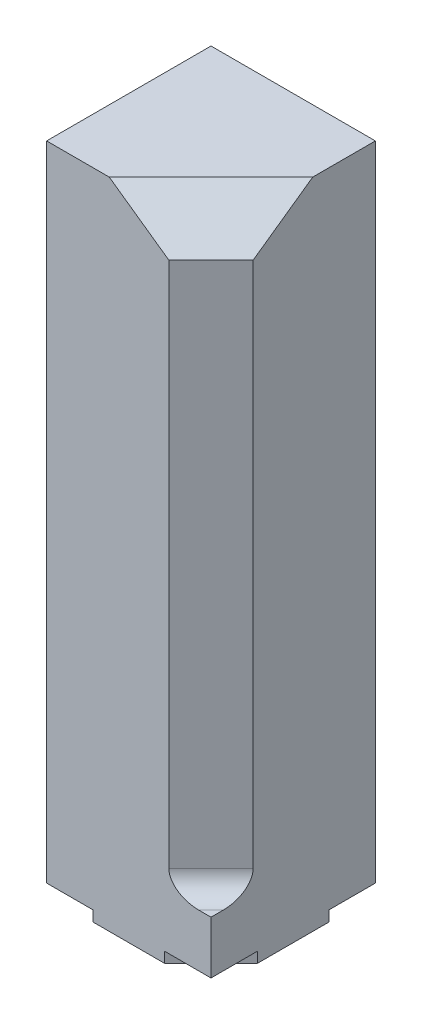
ISO-10303-21;
HEADER;
FILE_DESCRIPTION(('STEP AP214'),'2;1');
FILE_NAME('part.step','',(''),(''),'','','');
FILE_SCHEMA(('AUTOMOTIVE_DESIGN { 1 0 10303 214 1 1 1 1 }'));
ENDSEC;
DATA;
#1=APPLICATION_CONTEXT('core data for automotive mechanical design processes');
#2=APPLICATION_PROTOCOL_DEFINITION('international standard','automotive_design',2000,#1);
#3=PRODUCT_CONTEXT('',#1,'mechanical');
#4=PRODUCT('Part','Part','',(#3));
#5=PRODUCT_RELATED_PRODUCT_CATEGORY('part','',(#4));
#6=PRODUCT_DEFINITION_FORMATION('','',#4);
#7=PRODUCT_DEFINITION_CONTEXT('part definition',#1,'design');
#8=PRODUCT_DEFINITION('design','',#6,#7);
#9=PRODUCT_DEFINITION_SHAPE('','',#8);
#10=(LENGTH_UNIT() NAMED_UNIT(*) SI_UNIT(.MILLI.,.METRE.));
#11=(NAMED_UNIT(*) PLANE_ANGLE_UNIT() SI_UNIT($,.RADIAN.));
#12=(NAMED_UNIT(*) SI_UNIT($,.STERADIAN.) SOLID_ANGLE_UNIT());
#13=UNCERTAINTY_MEASURE_WITH_UNIT(LENGTH_MEASURE(1.E-05),#10,'distance_accuracy_value','');
#14=(GEOMETRIC_REPRESENTATION_CONTEXT(3) GLOBAL_UNCERTAINTY_ASSIGNED_CONTEXT((#13)) GLOBAL_UNIT_ASSIGNED_CONTEXT((#10,
#11,#12)) REPRESENTATION_CONTEXT('',''));
#15=CARTESIAN_POINT('',(0.,0.,0.));
#16=DIRECTION('',(0.,0.,1.));
#17=DIRECTION('',(1.,0.,0.));
#18=AXIS2_PLACEMENT_3D('',#15,#16,#17);
#19=CARTESIAN_POINT('',(0.,0.,0.));
#20=DIRECTION('',(0.,1.,0.));
#21=DIRECTION('',(0.,0.,1.));
#22=AXIS2_PLACEMENT_3D('',#19,#20,#21);
#23=PLANE('',#22);
#24=DIRECTION('',(-1.,0.,0.));
#25=VECTOR('',#24,1.);
#26=CARTESIAN_POINT('',(-1.95,0.,-1.95));
#27=LINE('',#26,#25);
#28=CARTESIAN_POINT('',(0.85,0.,-1.95));
#29=VERTEX_POINT('',#28);
#30=CARTESIAN_POINT('',(-0.85,0.,-1.95));
#31=VERTEX_POINT('',#30);
#32=EDGE_CURVE('E277',#29,#31,#27,.T.);
#33=ORIENTED_EDGE('',*,*,#32,.F.);
#34=DIRECTION('',(-0.707106781186548,0.,-0.707106781186548));
#35=VECTOR('',#34,1.);
#36=CARTESIAN_POINT('',(1.95,0.,-0.85));
#37=LINE('',#36,#35);
#38=CARTESIAN_POINT('',(1.1,0.,-1.7));
#39=VERTEX_POINT('',#38);
#40=EDGE_CURVE('E375',#39,#29,#37,.T.);
#41=ORIENTED_EDGE('',*,*,#40,.F.);
#42=DIRECTION('',(1.,0.,0.));
#43=VECTOR('',#42,1.);
#44=CARTESIAN_POINT('',(1.7,0.,-1.7));
#45=LINE('',#44,#43);
#46=CARTESIAN_POINT('',(-1.1,0.,-1.7));
#47=VERTEX_POINT('',#46);
#48=EDGE_CURVE('E346',#47,#39,#45,.T.);
#49=ORIENTED_EDGE('',*,*,#48,.F.);
#50=DIRECTION('',(-0.707106781186548,0.,0.707106781186548));
#51=VECTOR('',#50,1.);
#52=CARTESIAN_POINT('',(-0.85,0.,-1.95));
#53=LINE('',#52,#51);
#54=EDGE_CURVE('E204',#31,#47,#53,.T.);
#55=ORIENTED_EDGE('',*,*,#54,.F.);
#56=EDGE_LOOP('',(#33,#41,#49,#55));
#57=FACE_BOUND('',#56,.T.);
#58=ADVANCED_FACE('F33',(#57),#23,.F.);
#59=DIRECTION('',(1.,0.,0.));
#60=VECTOR('',#59,1.);
#61=CARTESIAN_POINT('',(-1.95,0.,1.95));
#62=LINE('',#61,#60);
#63=CARTESIAN_POINT('',(-0.85,0.,1.95));
#64=VERTEX_POINT('',#63);
#65=CARTESIAN_POINT('',(0.85,0.,1.95));
#66=VERTEX_POINT('',#65);
#67=EDGE_CURVE('E269',#64,#66,#62,.T.);
#68=ORIENTED_EDGE('',*,*,#67,.F.);
#69=DIRECTION('',(0.707106781186548,0.,0.707106781186547));
#70=VECTOR('',#69,1.);
#71=CARTESIAN_POINT('',(-0.85,0.,1.95));
#72=LINE('',#71,#70);
#73=CARTESIAN_POINT('',(-1.1,0.,1.7));
#74=VERTEX_POINT('',#73);
#75=EDGE_CURVE('E361',#74,#64,#72,.T.);
#76=ORIENTED_EDGE('',*,*,#75,.F.);
#77=DIRECTION('',(-1.,0.,0.));
#78=VECTOR('',#77,1.);
#79=CARTESIAN_POINT('',(1.7,0.,1.7));
#80=LINE('',#79,#78);
#81=CARTESIAN_POINT('',(1.1,0.,1.7));
#82=VERTEX_POINT('',#81);
#83=EDGE_CURVE('E336',#82,#74,#80,.T.);
#84=ORIENTED_EDGE('',*,*,#83,.F.);
#85=DIRECTION('',(0.707106781186548,0.,-0.707106781186548));
#86=VECTOR('',#85,1.);
#87=CARTESIAN_POINT('',(0.85,0.,1.95));
#88=LINE('',#87,#86);
#89=EDGE_CURVE('E299',#66,#82,#88,.T.);
#90=ORIENTED_EDGE('',*,*,#89,.F.);
#91=EDGE_LOOP('',(#68,#76,#84,#90));
#92=FACE_BOUND('',#91,.T.);
#93=ADVANCED_FACE('F360',(#92),#23,.F.);
#94=DIRECTION('',(0.,0.,-1.));
#95=VECTOR('',#94,1.);
#96=CARTESIAN_POINT('',(-1.7,0.,1.7));
#97=LINE('',#96,#95);
#98=CARTESIAN_POINT('',(-1.7,0.,1.1));
#99=VERTEX_POINT('',#98);
#100=CARTESIAN_POINT('',(-1.7,0.,-1.1));
#101=VERTEX_POINT('',#100);
#102=EDGE_CURVE('E332',#99,#101,#97,.T.);
#103=ORIENTED_EDGE('',*,*,#102,.F.);
#104=CARTESIAN_POINT('',(-1.95,0.,0.85));
#105=VERTEX_POINT('',#104);
#106=EDGE_CURVE('E365',#105,#99,#72,.T.);
#107=ORIENTED_EDGE('',*,*,#106,.F.);
#108=DIRECTION('',(0.,0.,1.));
#109=VECTOR('',#108,1.);
#110=CARTESIAN_POINT('',(-1.95,0.,-1.95));
#111=LINE('',#110,#109);
#112=CARTESIAN_POINT('',(-1.95,0.,-0.85));
#113=VERTEX_POINT('',#112);
#114=EDGE_CURVE('E279',#113,#105,#111,.T.);
#115=ORIENTED_EDGE('',*,*,#114,.F.);
#116=EDGE_CURVE('E406',#101,#113,#53,.T.);
#117=ORIENTED_EDGE('',*,*,#116,.F.);
#118=EDGE_LOOP('',(#103,#107,#115,#117));
#119=FACE_BOUND('',#118,.T.);
#120=ADVANCED_FACE('F456',(#119),#23,.F.);
#121=CARTESIAN_POINT('',(1.95,15.5,-1.95));
#122=DIRECTION('',(-1.,0.,0.));
#123=DIRECTION('',(0.,0.,1.));
#124=AXIS2_PLACEMENT_3D('',#121,#122,#123);
#125=PLANE('',#124);
#126=DIRECTION('',(0.,0.,-1.));
#127=VECTOR('',#126,1.);
#128=CARTESIAN_POINT('',(1.95,15.5,-1.95));
#129=LINE('',#128,#127);
#130=CARTESIAN_POINT('',(1.95,15.5,-0.464213562373091));
#131=VERTEX_POINT('',#130);
#132=CARTESIAN_POINT('',(1.95,15.5,-1.95));
#133=VERTEX_POINT('',#132);
#134=EDGE_CURVE('E266',#131,#133,#129,.T.);
#135=ORIENTED_EDGE('',*,*,#134,.F.);
#136=DIRECTION('',(0.,0.577350269189627,-0.816496580927725));
#137=VECTOR('',#136,1.);
#138=CARTESIAN_POINT('',(1.95,14.9309644062712,0.340524291751271));
#139=LINE('',#138,#137);
#140=CARTESIAN_POINT('',(1.95,14.5,0.95));
#141=VERTEX_POINT('',#140);
#142=EDGE_CURVE('E236',#131,#141,#139,.F.);
#143=ORIENTED_EDGE('',*,*,#142,.T.);
#144=DIRECTION('',(0.,1.,0.));
#145=VECTOR('',#144,1.);
#146=CARTESIAN_POINT('',(1.95,15.5,0.95));
#147=LINE('',#146,#145);
#148=CARTESIAN_POINT('',(1.95,2.,0.95));
#149=VERTEX_POINT('',#148);
#150=EDGE_CURVE('E250',#149,#141,#147,.T.);
#151=ORIENTED_EDGE('',*,*,#150,.F.);
#152=CARTESIAN_POINT('',(1.95,2.,1.65710678118655));
#153=DIRECTION('',(-1.,0.,0.));
#154=DIRECTION('',(0.,0.,1.));
#155=AXIS2_PLACEMENT_3D('',#152,#153,#154);
#156=ELLIPSE('',#155,0.707106781186547,0.5);
#157=CARTESIAN_POINT('',(1.95,1.5,1.65710678118655));
#158=VERTEX_POINT('',#157);
#159=EDGE_CURVE('E41',#149,#158,#156,.T.);
#160=ORIENTED_EDGE('',*,*,#159,.T.);
#161=DIRECTION('',(0.,0.,-1.));
#162=VECTOR('',#161,1.);
#163=CARTESIAN_POINT('',(1.95,1.5,-1.95));
#164=LINE('',#163,#162);
#165=CARTESIAN_POINT('',(1.95,1.5,1.95));
#166=VERTEX_POINT('',#165);
#167=EDGE_CURVE('E258',#166,#158,#164,.T.);
#168=ORIENTED_EDGE('',*,*,#167,.F.);
#169=DIRECTION('',(0.,-1.,0.));
#170=VECTOR('',#169,1.);
#171=CARTESIAN_POINT('',(1.95,15.5,1.95));
#172=LINE('',#171,#170);
#173=CARTESIAN_POINT('',(1.95,0.25,1.95));
#174=VERTEX_POINT('',#173);
#175=EDGE_CURVE('E228',#166,#174,#172,.T.);
#176=ORIENTED_EDGE('',*,*,#175,.T.);
#177=DIRECTION('',(0.,0.,1.));
#178=VECTOR('',#177,1.);
#179=CARTESIAN_POINT('',(1.95,0.25,0.85));
#180=LINE('',#179,#178);
#181=CARTESIAN_POINT('',(1.95,0.25,0.85));
#182=VERTEX_POINT('',#181);
#183=EDGE_CURVE('E286',#182,#174,#180,.T.);
#184=ORIENTED_EDGE('',*,*,#183,.F.);
#185=DIRECTION('',(0.,-1.,0.));
#186=VECTOR('',#185,1.);
#187=CARTESIAN_POINT('',(1.95,0.25,0.85));
#188=LINE('',#187,#186);
#189=CARTESIAN_POINT('',(1.95,0.,0.85));
#190=VERTEX_POINT('',#189);
#191=EDGE_CURVE('E305',#182,#190,#188,.T.);
#192=ORIENTED_EDGE('',*,*,#191,.T.);
#193=DIRECTION('',(0.,0.,-1.));
#194=VECTOR('',#193,1.);
#195=CARTESIAN_POINT('',(1.95,0.,-1.95));
#196=LINE('',#195,#194);
#197=CARTESIAN_POINT('',(1.95,0.,-0.85));
#198=VERTEX_POINT('',#197);
#199=EDGE_CURVE('E260',#190,#198,#196,.T.);
#200=ORIENTED_EDGE('',*,*,#199,.T.);
#201=DIRECTION('',(0.,-1.,0.));
#202=VECTOR('',#201,1.);
#203=CARTESIAN_POINT('',(1.95,0.25,-0.85));
#204=LINE('',#203,#202);
#205=CARTESIAN_POINT('',(1.95,0.25,-0.85));
#206=VERTEX_POINT('',#205);
#207=EDGE_CURVE('E388',#206,#198,#204,.T.);
#208=ORIENTED_EDGE('',*,*,#207,.F.);
#209=DIRECTION('',(0.,0.,1.));
#210=VECTOR('',#209,1.);
#211=CARTESIAN_POINT('',(1.95,0.25,-1.95));
#212=LINE('',#211,#210);
#213=CARTESIAN_POINT('',(1.95,0.25,-1.95));
#214=VERTEX_POINT('',#213);
#215=EDGE_CURVE('E400',#214,#206,#212,.T.);
#216=ORIENTED_EDGE('',*,*,#215,.F.);
#217=DIRECTION('',(0.,-1.,0.));
#218=VECTOR('',#217,1.);
#219=CARTESIAN_POINT('',(1.95,15.5,-1.95));
#220=LINE('',#219,#218);
#221=EDGE_CURVE('E221',#133,#214,#220,.T.);
#222=ORIENTED_EDGE('',*,*,#221,.F.);
#223=EDGE_LOOP('',(#135,#143,#151,#160,#168,#176,#184,#192,#200,#208,#216,#222));
#224=FACE_BOUND('',#223,.T.);
#225=ADVANCED_FACE('F256',(#224),#125,.F.);
#226=CARTESIAN_POINT('',(-1.95,15.5,1.95));
#227=DIRECTION('',(0.,0.,-1.));
#228=DIRECTION('',(-1.,0.,0.));
#229=AXIS2_PLACEMENT_3D('',#226,#227,#228);
#230=PLANE('',#229);
#231=DIRECTION('',(0.,-1.,0.));
#232=VECTOR('',#231,1.);
#233=CARTESIAN_POINT('',(0.95,15.5,1.95));
#234=LINE('',#233,#232);
#235=CARTESIAN_POINT('',(0.95,14.5,1.95));
#236=VERTEX_POINT('',#235);
#237=CARTESIAN_POINT('',(0.95,2.,1.95));
#238=VERTEX_POINT('',#237);
#239=EDGE_CURVE('E252',#236,#238,#234,.T.);
#240=ORIENTED_EDGE('',*,*,#239,.F.);
#241=DIRECTION('',(0.816496580927725,-0.577350269189627,0.));
#242=VECTOR('',#241,1.);
#243=CARTESIAN_POINT('',(0.340524291751271,14.9309644062712,1.95));
#244=LINE('',#243,#242);
#245=CARTESIAN_POINT('',(-0.464213562373091,15.5,1.95));
#246=VERTEX_POINT('',#245);
#247=EDGE_CURVE('E241',#236,#246,#244,.F.);
#248=ORIENTED_EDGE('',*,*,#247,.T.);
#249=DIRECTION('',(1.,0.,0.));
#250=VECTOR('',#249,1.);
#251=CARTESIAN_POINT('',(-1.95,15.5,1.95));
#252=LINE('',#251,#250);
#253=CARTESIAN_POINT('',(-1.95,15.5,1.95));
#254=VERTEX_POINT('',#253);
#255=EDGE_CURVE('E272',#254,#246,#252,.T.);
#256=ORIENTED_EDGE('',*,*,#255,.F.);
#257=DIRECTION('',(0.,-1.,0.));
#258=VECTOR('',#257,1.);
#259=CARTESIAN_POINT('',(-1.95,15.5,1.95));
#260=LINE('',#259,#258);
#261=CARTESIAN_POINT('',(-1.95,0.25,1.95));
#262=VERTEX_POINT('',#261);
#263=EDGE_CURVE('E222',#254,#262,#260,.T.);
#264=ORIENTED_EDGE('',*,*,#263,.T.);
#265=DIRECTION('',(-1.,0.,0.));
#266=VECTOR('',#265,1.);
#267=CARTESIAN_POINT('',(-1.95,0.25,1.95));
#268=LINE('',#267,#266);
#269=CARTESIAN_POINT('',(-0.85,0.25,1.95));
#270=VERTEX_POINT('',#269);
#271=EDGE_CURVE('E372',#270,#262,#268,.T.);
#272=ORIENTED_EDGE('',*,*,#271,.F.);
#273=DIRECTION('',(0.,-1.,0.));
#274=VECTOR('',#273,1.);
#275=CARTESIAN_POINT('',(-0.85,0.25,1.95));
#276=LINE('',#275,#274);
#277=EDGE_CURVE('E374',#270,#64,#276,.T.);
#278=ORIENTED_EDGE('',*,*,#277,.T.);
#279=ORIENTED_EDGE('',*,*,#67,.T.);
#280=DIRECTION('',(0.,-1.,0.));
#281=VECTOR('',#280,1.);
#282=CARTESIAN_POINT('',(0.85,0.25,1.95));
#283=LINE('',#282,#281);
#284=CARTESIAN_POINT('',(0.85,0.25,1.95));
#285=VERTEX_POINT('',#284);
#286=EDGE_CURVE('E292',#285,#66,#283,.T.);
#287=ORIENTED_EDGE('',*,*,#286,.F.);
#288=DIRECTION('',(-1.,0.,0.));
#289=VECTOR('',#288,1.);
#290=CARTESIAN_POINT('',(1.95,0.25,1.95));
#291=LINE('',#290,#289);
#292=EDGE_CURVE('E291',#174,#285,#291,.T.);
#293=ORIENTED_EDGE('',*,*,#292,.F.);
#294=ORIENTED_EDGE('',*,*,#175,.F.);
#295=DIRECTION('',(1.,0.,0.));
#296=VECTOR('',#295,1.);
#297=CARTESIAN_POINT('',(-1.95,1.5,1.95));
#298=LINE('',#297,#296);
#299=CARTESIAN_POINT('',(1.65710678118655,1.5,1.95));
#300=VERTEX_POINT('',#299);
#301=EDGE_CURVE('E225',#300,#166,#298,.T.);
#302=ORIENTED_EDGE('',*,*,#301,.F.);
#303=CARTESIAN_POINT('',(1.65710678118655,2.,1.95));
#304=DIRECTION('',(0.,0.,-1.));
#305=DIRECTION('',(-1.,0.,0.));
#306=AXIS2_PLACEMENT_3D('',#303,#304,#305);
#307=ELLIPSE('',#306,0.707106781186547,0.5);
#308=EDGE_CURVE('E11',#300,#238,#307,.T.);
#309=ORIENTED_EDGE('',*,*,#308,.T.);
#310=EDGE_LOOP('',(#240,#248,#256,#264,#272,#278,#279,#287,#293,#294,#302,#309));
#311=FACE_BOUND('',#310,.T.);
#312=ADVANCED_FACE('F289',(#311),#230,.F.);
#313=CARTESIAN_POINT('',(0.,15.5,0.));
#314=DIRECTION('',(0.,1.,0.));
#315=DIRECTION('',(0.,0.,1.));
#316=AXIS2_PLACEMENT_3D('',#313,#314,#315);
#317=PLANE('',#316);
#318=ORIENTED_EDGE('',*,*,#255,.T.);
#319=DIRECTION('',(0.707106781186548,0.,-0.707106781186548));
#320=VECTOR('',#319,1.);
#321=CARTESIAN_POINT('',(0.742893218813455,15.5,0.742893218813455));
#322=LINE('',#321,#320);
#323=EDGE_CURVE('E233',#246,#131,#322,.T.);
#324=ORIENTED_EDGE('',*,*,#323,.T.);
#325=ORIENTED_EDGE('',*,*,#134,.T.);
#326=DIRECTION('',(-1.,0.,0.));
#327=VECTOR('',#326,1.);
#328=CARTESIAN_POINT('',(-1.95,15.5,-1.95));
#329=LINE('',#328,#327);
#330=CARTESIAN_POINT('',(-1.95,15.5,-1.95));
#331=VERTEX_POINT('',#330);
#332=EDGE_CURVE('E268',#133,#331,#329,.T.);
#333=ORIENTED_EDGE('',*,*,#332,.T.);
#334=DIRECTION('',(0.,0.,1.));
#335=VECTOR('',#334,1.);
#336=CARTESIAN_POINT('',(-1.95,15.5,-1.95));
#337=LINE('',#336,#335);
#338=EDGE_CURVE('E220',#331,#254,#337,.T.);
#339=ORIENTED_EDGE('',*,*,#338,.T.);
#340=EDGE_LOOP('',(#318,#324,#325,#333,#339));
#341=FACE_BOUND('',#340,.T.);
#342=ADVANCED_FACE('F522',(#341),#317,.T.);
#343=CARTESIAN_POINT('',(-1.95,15.5,-1.95));
#344=DIRECTION('',(0.,0.,1.));
#345=DIRECTION('',(1.,0.,0.));
#346=AXIS2_PLACEMENT_3D('',#343,#344,#345);
#347=PLANE('',#346);
#348=DIRECTION('',(1.,0.,0.));
#349=VECTOR('',#348,1.);
#350=CARTESIAN_POINT('',(0.85,0.25,-1.95));
#351=LINE('',#350,#349);
#352=CARTESIAN_POINT('',(0.85,0.25,-1.95));
#353=VERTEX_POINT('',#352);
#354=EDGE_CURVE('E396',#353,#214,#351,.T.);
#355=ORIENTED_EDGE('',*,*,#354,.F.);
#356=DIRECTION('',(0.,-1.,0.));
#357=VECTOR('',#356,1.);
#358=CARTESIAN_POINT('',(0.85,0.25,-1.95));
#359=LINE('',#358,#357);
#360=EDGE_CURVE('E390',#353,#29,#359,.T.);
#361=ORIENTED_EDGE('',*,*,#360,.T.);
#362=ORIENTED_EDGE('',*,*,#32,.T.);
#363=DIRECTION('',(0.,-1.,0.));
#364=VECTOR('',#363,1.);
#365=CARTESIAN_POINT('',(-0.85,0.25,-1.95));
#366=LINE('',#365,#364);
#367=CARTESIAN_POINT('',(-0.85,0.25,-1.95));
#368=VERTEX_POINT('',#367);
#369=EDGE_CURVE('E215',#368,#31,#366,.T.);
#370=ORIENTED_EDGE('',*,*,#369,.F.);
#371=DIRECTION('',(1.,0.,0.));
#372=VECTOR('',#371,1.);
#373=CARTESIAN_POINT('',(-1.95,0.25,-1.95));
#374=LINE('',#373,#372);
#375=CARTESIAN_POINT('',(-1.95,0.25,-1.95));
#376=VERTEX_POINT('',#375);
#377=EDGE_CURVE('E196',#376,#368,#374,.T.);
#378=ORIENTED_EDGE('',*,*,#377,.F.);
#379=DIRECTION('',(0.,-1.,0.));
#380=VECTOR('',#379,1.);
#381=CARTESIAN_POINT('',(-1.95,15.5,-1.95));
#382=LINE('',#381,#380);
#383=EDGE_CURVE('E212',#331,#376,#382,.T.);
#384=ORIENTED_EDGE('',*,*,#383,.F.);
#385=ORIENTED_EDGE('',*,*,#332,.F.);
#386=ORIENTED_EDGE('',*,*,#221,.T.);
#387=EDGE_LOOP('',(#355,#361,#362,#370,#378,#384,#385,#386));
#388=FACE_BOUND('',#387,.T.);
#389=ADVANCED_FACE('F210',(#388),#347,.F.);
#390=CARTESIAN_POINT('',(-1.95,15.5,-1.95));
#391=DIRECTION('',(1.,0.,0.));
#392=DIRECTION('',(0.,0.,-1.));
#393=AXIS2_PLACEMENT_3D('',#390,#391,#392);
#394=PLANE('',#393);
#395=ORIENTED_EDGE('',*,*,#114,.T.);
#396=DIRECTION('',(0.,-1.,0.));
#397=VECTOR('',#396,1.);
#398=CARTESIAN_POINT('',(-1.95,0.25,0.85));
#399=LINE('',#398,#397);
#400=CARTESIAN_POINT('',(-1.95,0.25,0.85));
#401=VERTEX_POINT('',#400);
#402=EDGE_CURVE('E376',#401,#105,#399,.T.);
#403=ORIENTED_EDGE('',*,*,#402,.F.);
#404=DIRECTION('',(0.,0.,-1.));
#405=VECTOR('',#404,1.);
#406=CARTESIAN_POINT('',(-1.95,0.25,0.85));
#407=LINE('',#406,#405);
#408=EDGE_CURVE('E368',#262,#401,#407,.T.);
#409=ORIENTED_EDGE('',*,*,#408,.F.);
#410=ORIENTED_EDGE('',*,*,#263,.F.);
#411=ORIENTED_EDGE('',*,*,#338,.F.);
#412=ORIENTED_EDGE('',*,*,#383,.T.);
#413=DIRECTION('',(0.,0.,-1.));
#414=VECTOR('',#413,1.);
#415=CARTESIAN_POINT('',(-1.95,0.25,-0.85));
#416=LINE('',#415,#414);
#417=CARTESIAN_POINT('',(-1.95,0.25,-0.85));
#418=VERTEX_POINT('',#417);
#419=EDGE_CURVE('E192',#418,#376,#416,.T.);
#420=ORIENTED_EDGE('',*,*,#419,.F.);
#421=DIRECTION('',(0.,-1.,0.));
#422=VECTOR('',#421,1.);
#423=CARTESIAN_POINT('',(-1.95,0.25,-0.85));
#424=LINE('',#423,#422);
#425=EDGE_CURVE('E366',#418,#113,#424,.T.);
#426=ORIENTED_EDGE('',*,*,#425,.T.);
#427=EDGE_LOOP('',(#395,#403,#409,#410,#411,#412,#420,#426));
#428=FACE_BOUND('',#427,.T.);
#429=ADVANCED_FACE('F218',(#428),#394,.F.);
#430=DIRECTION('',(0.,0.,1.));
#431=VECTOR('',#430,1.);
#432=CARTESIAN_POINT('',(1.7,0.,1.7));
#433=LINE('',#432,#431);
#434=CARTESIAN_POINT('',(1.7,0.,-1.1));
#435=VERTEX_POINT('',#434);
#436=CARTESIAN_POINT('',(1.7,0.,1.1));
#437=VERTEX_POINT('',#436);
#438=EDGE_CURVE('E349',#435,#437,#433,.T.);
#439=ORIENTED_EDGE('',*,*,#438,.F.);
#440=EDGE_CURVE('E394',#198,#435,#37,.T.);
#441=ORIENTED_EDGE('',*,*,#440,.F.);
#442=ORIENTED_EDGE('',*,*,#199,.F.);
#443=EDGE_CURVE('E304',#437,#190,#88,.T.);
#444=ORIENTED_EDGE('',*,*,#443,.F.);
#445=EDGE_LOOP('',(#439,#441,#442,#444));
#446=FACE_BOUND('',#445,.T.);
#447=ADVANCED_FACE('F431',(#446),#23,.F.);
#448=CARTESIAN_POINT('',(1.24289321881345,1.5,2.65710678118655));
#449=DIRECTION('',(0.,1.,0.));
#450=DIRECTION('',(0.,0.,1.));
#451=AXIS2_PLACEMENT_3D('',#448,#449,#450);
#452=PLANE('',#451);
#453=ORIENTED_EDGE('',*,*,#167,.T.);
#454=DIRECTION('',(0.707106781186548,0.,-0.707106781186548));
#455=VECTOR('',#454,1.);
#456=CARTESIAN_POINT('',(1.30355339059327,1.5,2.30355339059327));
#457=LINE('',#456,#455);
#458=EDGE_CURVE('E48',#158,#300,#457,.F.);
#459=ORIENTED_EDGE('',*,*,#458,.T.);
#460=ORIENTED_EDGE('',*,*,#301,.T.);
#461=EDGE_LOOP('',(#453,#459,#460));
#462=FACE_BOUND('',#461,.T.);
#463=ADVANCED_FACE('F460',(#462),#452,.T.);
#464=CARTESIAN_POINT('',(1.45,0.,1.45));
#465=DIRECTION('',(0.707106781186548,0.,0.707106781186548));
#466=DIRECTION('',(0.707106781186548,0.,-0.707106781186548));
#467=AXIS2_PLACEMENT_3D('',#464,#465,#466);
#468=PLANE('',#467);
#469=ORIENTED_EDGE('',*,*,#239,.T.);
#470=DIRECTION('',(0.707106781186548,0.,-0.707106781186548));
#471=VECTOR('',#470,1.);
#472=CARTESIAN_POINT('',(1.95,2.,0.95));
#473=LINE('',#472,#471);
#474=EDGE_CURVE('E243',#238,#149,#473,.T.);
#475=ORIENTED_EDGE('',*,*,#474,.T.);
#476=ORIENTED_EDGE('',*,*,#150,.T.);
#477=DIRECTION('',(-0.707106781186548,0.,0.707106781186548));
#478=VECTOR('',#477,1.);
#479=CARTESIAN_POINT('',(1.45,14.5,1.45));
#480=LINE('',#479,#478);
#481=EDGE_CURVE('E239',#141,#236,#480,.T.);
#482=ORIENTED_EDGE('',*,*,#481,.T.);
#483=EDGE_LOOP('',(#469,#475,#476,#482));
#484=FACE_BOUND('',#483,.T.);
#485=ADVANCED_FACE('F249',(#484),#468,.T.);
#486=CARTESIAN_POINT('',(-1.7,0.25,1.7));
#487=DIRECTION('',(-1.,0.,0.));
#488=DIRECTION('',(0.,0.,1.));
#489=AXIS2_PLACEMENT_3D('',#486,#487,#488);
#490=PLANE('',#489);
#491=DIRECTION('',(0.,0.,-1.));
#492=VECTOR('',#491,1.);
#493=CARTESIAN_POINT('',(-1.7,0.25,1.7));
#494=LINE('',#493,#492);
#495=CARTESIAN_POINT('',(-1.7,0.25,1.1));
#496=VERTEX_POINT('',#495);
#497=CARTESIAN_POINT('',(-1.7,0.25,-1.1));
#498=VERTEX_POINT('',#497);
#499=EDGE_CURVE('E333',#496,#498,#494,.T.);
#500=ORIENTED_EDGE('',*,*,#499,.F.);
#501=DIRECTION('',(0.,-1.,0.));
#502=VECTOR('',#501,1.);
#503=CARTESIAN_POINT('',(-1.7,0.25,1.1));
#504=LINE('',#503,#502);
#505=EDGE_CURVE('E323',#496,#99,#504,.T.);
#506=ORIENTED_EDGE('',*,*,#505,.T.);
#507=ORIENTED_EDGE('',*,*,#102,.T.);
#508=DIRECTION('',(0.,1.,0.));
#509=VECTOR('',#508,1.);
#510=CARTESIAN_POINT('',(-1.7,0.25,-1.1));
#511=LINE('',#510,#509);
#512=EDGE_CURVE('E317',#101,#498,#511,.T.);
#513=ORIENTED_EDGE('',*,*,#512,.T.);
#514=EDGE_LOOP('',(#500,#506,#507,#513));
#515=FACE_BOUND('',#514,.T.);
#516=ADVANCED_FACE('F477',(#515),#490,.F.);
#517=CARTESIAN_POINT('',(1.7,0.25,1.7));
#518=DIRECTION('',(0.,0.,1.));
#519=DIRECTION('',(1.,0.,0.));
#520=AXIS2_PLACEMENT_3D('',#517,#518,#519);
#521=PLANE('',#520);
#522=ORIENTED_EDGE('',*,*,#83,.T.);
#523=DIRECTION('',(0.,1.,0.));
#524=VECTOR('',#523,1.);
#525=CARTESIAN_POINT('',(-1.1,0.25,1.7));
#526=LINE('',#525,#524);
#527=CARTESIAN_POINT('',(-1.1,0.25,1.7));
#528=VERTEX_POINT('',#527);
#529=EDGE_CURVE('E320',#74,#528,#526,.T.);
#530=ORIENTED_EDGE('',*,*,#529,.T.);
#531=DIRECTION('',(-1.,0.,0.));
#532=VECTOR('',#531,1.);
#533=CARTESIAN_POINT('',(1.7,0.25,1.7));
#534=LINE('',#533,#532);
#535=CARTESIAN_POINT('',(1.1,0.25,1.7));
#536=VERTEX_POINT('',#535);
#537=EDGE_CURVE('E262',#536,#528,#534,.T.);
#538=ORIENTED_EDGE('',*,*,#537,.F.);
#539=DIRECTION('',(0.,-1.,0.));
#540=VECTOR('',#539,1.);
#541=CARTESIAN_POINT('',(1.1,0.25,1.7));
#542=LINE('',#541,#540);
#543=EDGE_CURVE('E311',#536,#82,#542,.T.);
#544=ORIENTED_EDGE('',*,*,#543,.T.);
#545=EDGE_LOOP('',(#522,#530,#538,#544));
#546=FACE_BOUND('',#545,.T.);
#547=ADVANCED_FACE('F354',(#546),#521,.F.);
#548=CARTESIAN_POINT('',(1.7,0.25,1.7));
#549=DIRECTION('',(1.,0.,0.));
#550=DIRECTION('',(0.,0.,-1.));
#551=AXIS2_PLACEMENT_3D('',#548,#549,#550);
#552=PLANE('',#551);
#553=DIRECTION('',(0.,0.,1.));
#554=VECTOR('',#553,1.);
#555=CARTESIAN_POINT('',(1.7,0.25,1.7));
#556=LINE('',#555,#554);
#557=CARTESIAN_POINT('',(1.7,0.25,-1.1));
#558=VERTEX_POINT('',#557);
#559=CARTESIAN_POINT('',(1.7,0.25,1.1));
#560=VERTEX_POINT('',#559);
#561=EDGE_CURVE('E339',#558,#560,#556,.T.);
#562=ORIENTED_EDGE('',*,*,#561,.F.);
#563=DIRECTION('',(0.,-1.,0.));
#564=VECTOR('',#563,1.);
#565=CARTESIAN_POINT('',(1.7,0.25,-1.1));
#566=LINE('',#565,#564);
#567=EDGE_CURVE('E329',#558,#435,#566,.T.);
#568=ORIENTED_EDGE('',*,*,#567,.T.);
#569=ORIENTED_EDGE('',*,*,#438,.T.);
#570=DIRECTION('',(0.,1.,0.));
#571=VECTOR('',#570,1.);
#572=CARTESIAN_POINT('',(1.7,0.25,1.1));
#573=LINE('',#572,#571);
#574=EDGE_CURVE('E307',#437,#560,#573,.T.);
#575=ORIENTED_EDGE('',*,*,#574,.T.);
#576=EDGE_LOOP('',(#562,#568,#569,#575));
#577=FACE_BOUND('',#576,.T.);
#578=ADVANCED_FACE('F435',(#577),#552,.F.);
#579=CARTESIAN_POINT('',(1.7,0.25,-1.7));
#580=DIRECTION('',(0.,0.,-1.));
#581=DIRECTION('',(-1.,0.,0.));
#582=AXIS2_PLACEMENT_3D('',#579,#580,#581);
#583=PLANE('',#582);
#584=ORIENTED_EDGE('',*,*,#48,.T.);
#585=DIRECTION('',(0.,1.,0.));
#586=VECTOR('',#585,1.);
#587=CARTESIAN_POINT('',(1.1,0.25,-1.7));
#588=LINE('',#587,#586);
#589=CARTESIAN_POINT('',(1.1,0.25,-1.7));
#590=VERTEX_POINT('',#589);
#591=EDGE_CURVE('E326',#39,#590,#588,.T.);
#592=ORIENTED_EDGE('',*,*,#591,.T.);
#593=DIRECTION('',(1.,0.,0.));
#594=VECTOR('',#593,1.);
#595=CARTESIAN_POINT('',(1.7,0.25,-1.7));
#596=LINE('',#595,#594);
#597=CARTESIAN_POINT('',(-1.1,0.25,-1.7));
#598=VERTEX_POINT('',#597);
#599=EDGE_CURVE('E335',#598,#590,#596,.T.);
#600=ORIENTED_EDGE('',*,*,#599,.F.);
#601=DIRECTION('',(0.,-1.,0.));
#602=VECTOR('',#601,1.);
#603=CARTESIAN_POINT('',(-1.1,0.25,-1.7));
#604=LINE('',#603,#602);
#605=EDGE_CURVE('E314',#598,#47,#604,.T.);
#606=ORIENTED_EDGE('',*,*,#605,.T.);
#607=EDGE_LOOP('',(#584,#592,#600,#606));
#608=FACE_BOUND('',#607,.T.);
#609=ADVANCED_FACE('F414',(#608),#583,.F.);
#610=CARTESIAN_POINT('',(0.,0.25,0.));
#611=DIRECTION('',(0.,1.,0.));
#612=DIRECTION('',(0.,0.,1.));
#613=AXIS2_PLACEMENT_3D('',#610,#611,#612);
#614=PLANE('',#613);
#615=DIRECTION('',(0.707106781186548,0.,0.707106781186547));
#616=VECTOR('',#615,1.);
#617=CARTESIAN_POINT('',(-0.85,0.25,1.95));
#618=LINE('',#617,#616);
#619=EDGE_CURVE('E380',#401,#496,#618,.T.);
#620=ORIENTED_EDGE('',*,*,#619,.T.);
#621=ORIENTED_EDGE('',*,*,#499,.T.);
#622=DIRECTION('',(-0.707106781186548,0.,0.707106781186548));
#623=VECTOR('',#622,1.);
#624=CARTESIAN_POINT('',(-0.85,0.25,-1.95));
#625=LINE('',#624,#623);
#626=EDGE_CURVE('E199',#498,#418,#625,.T.);
#627=ORIENTED_EDGE('',*,*,#626,.T.);
#628=ORIENTED_EDGE('',*,*,#419,.T.);
#629=ORIENTED_EDGE('',*,*,#377,.T.);
#630=EDGE_CURVE('E403',#368,#598,#625,.T.);
#631=ORIENTED_EDGE('',*,*,#630,.T.);
#632=ORIENTED_EDGE('',*,*,#599,.T.);
#633=DIRECTION('',(-0.707106781186548,0.,-0.707106781186548));
#634=VECTOR('',#633,1.);
#635=CARTESIAN_POINT('',(1.95,0.25,-0.85));
#636=LINE('',#635,#634);
#637=EDGE_CURVE('E399',#590,#353,#636,.T.);
#638=ORIENTED_EDGE('',*,*,#637,.T.);
#639=ORIENTED_EDGE('',*,*,#354,.T.);
#640=ORIENTED_EDGE('',*,*,#215,.T.);
#641=EDGE_CURVE('E391',#206,#558,#636,.T.);
#642=ORIENTED_EDGE('',*,*,#641,.T.);
#643=ORIENTED_EDGE('',*,*,#561,.T.);
#644=DIRECTION('',(0.707106781186548,0.,-0.707106781186548));
#645=VECTOR('',#644,1.);
#646=CARTESIAN_POINT('',(0.85,0.25,1.95));
#647=LINE('',#646,#645);
#648=EDGE_CURVE('E295',#560,#182,#647,.T.);
#649=ORIENTED_EDGE('',*,*,#648,.T.);
#650=ORIENTED_EDGE('',*,*,#183,.T.);
#651=ORIENTED_EDGE('',*,*,#292,.T.);
#652=EDGE_CURVE('E297',#285,#536,#647,.T.);
#653=ORIENTED_EDGE('',*,*,#652,.T.);
#654=ORIENTED_EDGE('',*,*,#537,.T.);
#655=EDGE_CURVE('E384',#528,#270,#618,.T.);
#656=ORIENTED_EDGE('',*,*,#655,.T.);
#657=ORIENTED_EDGE('',*,*,#271,.T.);
#658=ORIENTED_EDGE('',*,*,#408,.T.);
#659=EDGE_LOOP('',(#620,#621,#627,#628,#629,#631,#632,#638,#639,#640,#642,#643,#649,#650,#651,
#653,#654,#656,#657,#658));
#660=FACE_BOUND('',#659,.T.);
#661=ADVANCED_FACE('F195',(#660),#614,.F.);
#662=CARTESIAN_POINT('',(-0.85,0.25,-1.95));
#663=DIRECTION('',(0.707106781186547,0.,0.707106781186547));
#664=DIRECTION('',(0.707106781186548,0.,-0.707106781186548));
#665=AXIS2_PLACEMENT_3D('',#662,#663,#664);
#666=PLANE('',#665);
#667=ORIENTED_EDGE('',*,*,#116,.T.);
#668=ORIENTED_EDGE('',*,*,#425,.F.);
#669=ORIENTED_EDGE('',*,*,#626,.F.);
#670=ORIENTED_EDGE('',*,*,#512,.F.);
#671=EDGE_LOOP('',(#667,#668,#669,#670));
#672=FACE_BOUND('',#671,.T.);
#673=ADVANCED_FACE('F479',(#672),#666,.F.);
#674=ORIENTED_EDGE('',*,*,#630,.F.);
#675=ORIENTED_EDGE('',*,*,#369,.T.);
#676=ORIENTED_EDGE('',*,*,#54,.T.);
#677=ORIENTED_EDGE('',*,*,#605,.F.);
#678=EDGE_LOOP('',(#674,#675,#676,#677));
#679=FACE_BOUND('',#678,.T.);
#680=ADVANCED_FACE('F410',(#679),#666,.F.);
#681=CARTESIAN_POINT('',(1.95,0.25,-0.85));
#682=DIRECTION('',(-0.707106781186547,0.,0.707106781186547));
#683=DIRECTION('',(0.707106781186548,0.,0.707106781186548));
#684=AXIS2_PLACEMENT_3D('',#681,#682,#683);
#685=PLANE('',#684);
#686=ORIENTED_EDGE('',*,*,#641,.F.);
#687=ORIENTED_EDGE('',*,*,#207,.T.);
#688=ORIENTED_EDGE('',*,*,#440,.T.);
#689=ORIENTED_EDGE('',*,*,#567,.F.);
#690=EDGE_LOOP('',(#686,#687,#688,#689));
#691=FACE_BOUND('',#690,.T.);
#692=ADVANCED_FACE('F428',(#691),#685,.F.);
#693=ORIENTED_EDGE('',*,*,#40,.T.);
#694=ORIENTED_EDGE('',*,*,#360,.F.);
#695=ORIENTED_EDGE('',*,*,#637,.F.);
#696=ORIENTED_EDGE('',*,*,#591,.F.);
#697=EDGE_LOOP('',(#693,#694,#695,#696));
#698=FACE_BOUND('',#697,.T.);
#699=ADVANCED_FACE('F417',(#698),#685,.F.);
#700=CARTESIAN_POINT('',(0.85,0.25,1.95));
#701=DIRECTION('',(-0.707106781186547,0.,-0.707106781186547));
#702=DIRECTION('',(-0.707106781186548,0.,0.707106781186548));
#703=AXIS2_PLACEMENT_3D('',#700,#701,#702);
#704=PLANE('',#703);
#705=ORIENTED_EDGE('',*,*,#652,.F.);
#706=ORIENTED_EDGE('',*,*,#286,.T.);
#707=ORIENTED_EDGE('',*,*,#89,.T.);
#708=ORIENTED_EDGE('',*,*,#543,.F.);
#709=EDGE_LOOP('',(#705,#706,#707,#708));
#710=FACE_BOUND('',#709,.T.);
#711=ADVANCED_FACE('F441',(#710),#704,.F.);
#712=ORIENTED_EDGE('',*,*,#443,.T.);
#713=ORIENTED_EDGE('',*,*,#191,.F.);
#714=ORIENTED_EDGE('',*,*,#648,.F.);
#715=ORIENTED_EDGE('',*,*,#574,.F.);
#716=EDGE_LOOP('',(#712,#713,#714,#715));
#717=FACE_BOUND('',#716,.T.);
#718=ADVANCED_FACE('F438',(#717),#704,.F.);
#719=CARTESIAN_POINT('',(-0.85,0.25,1.95));
#720=DIRECTION('',(0.707106781186547,0.,-0.707106781186548));
#721=DIRECTION('',(-0.707106781186548,0.,-0.707106781186547));
#722=AXIS2_PLACEMENT_3D('',#719,#720,#721);
#723=PLANE('',#722);
#724=ORIENTED_EDGE('',*,*,#619,.F.);
#725=ORIENTED_EDGE('',*,*,#402,.T.);
#726=ORIENTED_EDGE('',*,*,#106,.T.);
#727=ORIENTED_EDGE('',*,*,#505,.F.);
#728=EDGE_LOOP('',(#724,#725,#726,#727));
#729=FACE_BOUND('',#728,.T.);
#730=ADVANCED_FACE('F440',(#729),#723,.F.);
#731=ORIENTED_EDGE('',*,*,#75,.T.);
#732=ORIENTED_EDGE('',*,*,#277,.F.);
#733=ORIENTED_EDGE('',*,*,#655,.F.);
#734=ORIENTED_EDGE('',*,*,#529,.F.);
#735=EDGE_LOOP('',(#731,#732,#733,#734));
#736=FACE_BOUND('',#735,.T.);
#737=ADVANCED_FACE('F447',(#736),#723,.F.);
#738=CARTESIAN_POINT('',(0.742893218813455,15.5,0.742893218813455));
#739=DIRECTION('',(-0.500000000000001,-0.707106781186546,-0.500000000000001));
#740=DIRECTION('',(0.707106781186548,0.,-0.707106781186548));
#741=AXIS2_PLACEMENT_3D('',#738,#739,#740);
#742=PLANE('',#741);
#743=ORIENTED_EDGE('',*,*,#247,.F.);
#744=ORIENTED_EDGE('',*,*,#481,.F.);
#745=ORIENTED_EDGE('',*,*,#142,.F.);
#746=ORIENTED_EDGE('',*,*,#323,.F.);
#747=EDGE_LOOP('',(#743,#744,#745,#746));
#748=FACE_BOUND('',#747,.T.);
#749=ADVANCED_FACE('F516',(#748),#742,.F.);
#750=CARTESIAN_POINT('',(1.80355339059327,2.,1.80355339059327));
#751=DIRECTION('',(-0.707106781186548,0.,0.707106781186548));
#752=DIRECTION('',(0.707106781186548,0.,0.707106781186548));
#753=AXIS2_PLACEMENT_3D('',#750,#751,#752);
#754=CYLINDRICAL_SURFACE('',#753,0.5);
#755=ORIENTED_EDGE('',*,*,#308,.F.);
#756=ORIENTED_EDGE('',*,*,#458,.F.);
#757=ORIENTED_EDGE('',*,*,#159,.F.);
#758=ORIENTED_EDGE('',*,*,#474,.F.);
#759=EDGE_LOOP('',(#755,#756,#757,#758));
#760=FACE_BOUND('',#759,.T.);
#761=ADVANCED_FACE('F35',(#760),#754,.F.);
#762=CLOSED_SHELL('',(#58,#93,#120,#225,#312,#342,#389,#429,#447,#463,#485,#516,#547,#578,#609,
#661,#673,#680,#692,#699,#711,#718,#730,#737,#749,#761));
#763=MANIFOLD_SOLID_BREP('B2',#762);
#764=ADVANCED_BREP_SHAPE_REPRESENTATION('',(#18,#763),#14);
#765=SHAPE_DEFINITION_REPRESENTATION(#9,#764);
ENDSEC;
END-ISO-10303-21;
